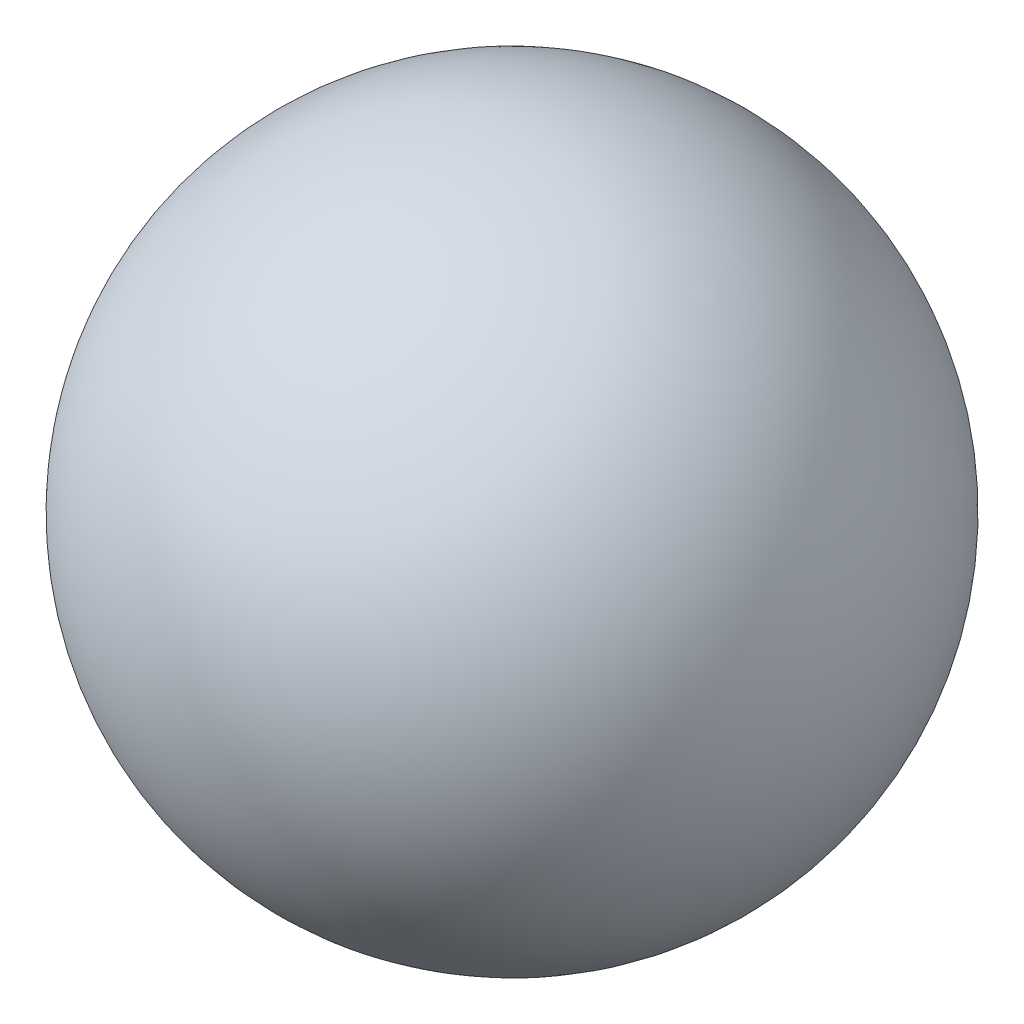
ISO-10303-21;
HEADER;
FILE_DESCRIPTION(('STEP AP214'),'2;1');
FILE_NAME('part.step','',(''),(''),'','','');
FILE_SCHEMA(('AUTOMOTIVE_DESIGN { 1 0 10303 214 1 1 1 1 }'));
ENDSEC;
DATA;
#1=APPLICATION_CONTEXT('core data for automotive mechanical design processes');
#2=APPLICATION_PROTOCOL_DEFINITION('international standard','automotive_design',2000,#1);
#3=PRODUCT_CONTEXT('',#1,'mechanical');
#4=PRODUCT('Part','Part','',(#3));
#5=PRODUCT_RELATED_PRODUCT_CATEGORY('part','',(#4));
#6=PRODUCT_DEFINITION_FORMATION('','',#4);
#7=PRODUCT_DEFINITION_CONTEXT('part definition',#1,'design');
#8=PRODUCT_DEFINITION('design','',#6,#7);
#9=PRODUCT_DEFINITION_SHAPE('','',#8);
#10=(LENGTH_UNIT() NAMED_UNIT(*) SI_UNIT(.MILLI.,.METRE.));
#11=(NAMED_UNIT(*) PLANE_ANGLE_UNIT() SI_UNIT($,.RADIAN.));
#12=(NAMED_UNIT(*) SI_UNIT($,.STERADIAN.) SOLID_ANGLE_UNIT());
#13=UNCERTAINTY_MEASURE_WITH_UNIT(LENGTH_MEASURE(1.E-05),#10,'distance_accuracy_value','');
#14=(GEOMETRIC_REPRESENTATION_CONTEXT(3) GLOBAL_UNCERTAINTY_ASSIGNED_CONTEXT((#13)) GLOBAL_UNIT_ASSIGNED_CONTEXT((#10,
#11,#12)) REPRESENTATION_CONTEXT('',''));
#15=CARTESIAN_POINT('',(0.,0.,0.));
#16=DIRECTION('',(0.,0.,1.));
#17=DIRECTION('',(1.,0.,0.));
#18=AXIS2_PLACEMENT_3D('',#15,#16,#17);
#19=CARTESIAN_POINT('',(57.535,60.3514657083656,-11.9927511064795));
#20=DIRECTION('',(0.,0.980822273280607,-0.194904254024027));
#21=DIRECTION('',(0.173648177666934,0.191943220457923,0.9659213790538));
#22=AXIS2_PLACEMENT_3D('',#19,#20,#21);
#23=SPHERICAL_SURFACE('',#22,6.75);
#24=CARTESIAN_POINT('',(57.535,66.9720160530097,-13.3083548211417));
#25=VERTEX_POINT('',#24);
#26=VERTEX_LOOP('',#25);
#27=FACE_BOUND('',#26,.T.);
#28=CARTESIAN_POINT('',(57.535,53.7309153637215,-10.6771473918173));
#29=VERTEX_POINT('',#28);
#30=VERTEX_LOOP('',#29);
#31=FACE_BOUND('',#30,.T.);
#32=ADVANCED_FACE('F16',(#27,#31),#23,.T.);
#33=CLOSED_SHELL('',(#32));
#34=MANIFOLD_SOLID_BREP('B1',#33);
#35=ADVANCED_BREP_SHAPE_REPRESENTATION('',(#18,#34),#14);
#36=SHAPE_DEFINITION_REPRESENTATION(#9,#35);
ENDSEC;
END-ISO-10303-21;
